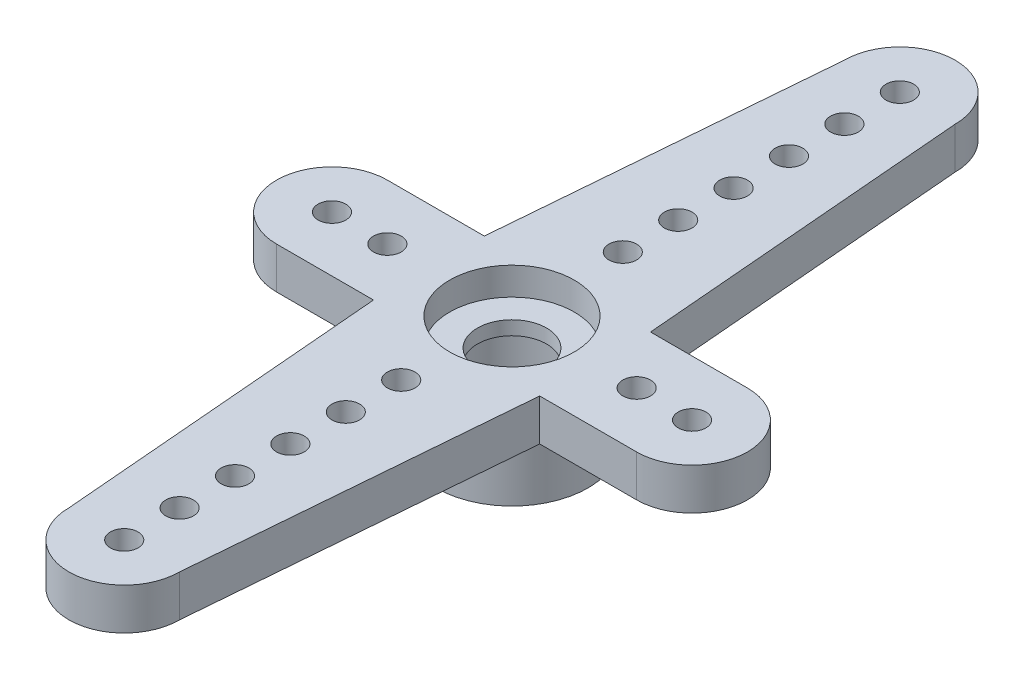
ISO-10303-21;
HEADER;
FILE_DESCRIPTION(('STEP AP214'),'2;1');
FILE_NAME('part.step','',(''),(''),'','','');
FILE_SCHEMA(('AUTOMOTIVE_DESIGN { 1 0 10303 214 1 1 1 1 }'));
ENDSEC;
DATA;
#1=APPLICATION_CONTEXT('core data for automotive mechanical design processes');
#2=APPLICATION_PROTOCOL_DEFINITION('international standard','automotive_design',2000,#1);
#3=PRODUCT_CONTEXT('',#1,'mechanical');
#4=PRODUCT('Part','Part','',(#3));
#5=PRODUCT_RELATED_PRODUCT_CATEGORY('part','',(#4));
#6=PRODUCT_DEFINITION_FORMATION('','',#4);
#7=PRODUCT_DEFINITION_CONTEXT('part definition',#1,'design');
#8=PRODUCT_DEFINITION('design','',#6,#7);
#9=PRODUCT_DEFINITION_SHAPE('','',#8);
#10=(LENGTH_UNIT() NAMED_UNIT(*) SI_UNIT(.MILLI.,.METRE.));
#11=(NAMED_UNIT(*) PLANE_ANGLE_UNIT() SI_UNIT($,.RADIAN.));
#12=(NAMED_UNIT(*) SI_UNIT($,.STERADIAN.) SOLID_ANGLE_UNIT());
#13=UNCERTAINTY_MEASURE_WITH_UNIT(LENGTH_MEASURE(1.E-05),#10,'distance_accuracy_value','');
#14=(GEOMETRIC_REPRESENTATION_CONTEXT(3) GLOBAL_UNCERTAINTY_ASSIGNED_CONTEXT((#13)) GLOBAL_UNIT_ASSIGNED_CONTEXT((#10,
#11,#12)) REPRESENTATION_CONTEXT('',''));
#15=CARTESIAN_POINT('',(0.,0.,0.));
#16=DIRECTION('',(0.,0.,1.));
#17=DIRECTION('',(1.,0.,0.));
#18=AXIS2_PLACEMENT_3D('',#15,#16,#17);
#19=CARTESIAN_POINT('',(0.,0.,0.));
#20=DIRECTION('',(0.,1.,0.));
#21=DIRECTION('',(0.,0.,1.));
#22=AXIS2_PLACEMENT_3D('',#19,#20,#21);
#23=PLANE('',#22);
#24=CARTESIAN_POINT('',(0.,0.,0.));
#25=DIRECTION('',(0.,1.,0.));
#26=DIRECTION('',(0.,0.,1.));
#27=AXIS2_PLACEMENT_3D('',#24,#25,#26);
#28=CIRCLE('',#27,2.75);
#29=CARTESIAN_POINT('',(0.,0.,2.75));
#30=VERTEX_POINT('',#29);
#31=EDGE_CURVE('E36',#30,#30,#28,.T.);
#32=ORIENTED_EDGE('',*,*,#31,.F.);
#33=EDGE_LOOP('',(#32));
#34=FACE_BOUND('',#33,.T.);
#35=CARTESIAN_POINT('',(0.,0.,0.));
#36=DIRECTION('',(0.,1.,0.));
#37=DIRECTION('',(0.,0.,1.));
#38=AXIS2_PLACEMENT_3D('',#35,#36,#37);
#39=CIRCLE('',#38,2.25);
#40=CARTESIAN_POINT('',(0.,0.,2.25));
#41=VERTEX_POINT('',#40);
#42=EDGE_CURVE('E207',#41,#41,#39,.T.);
#43=ORIENTED_EDGE('',*,*,#42,.T.);
#44=EDGE_LOOP('',(#43));
#45=FACE_BOUND('',#44,.T.);
#46=ADVANCED_FACE('F32',(#34,#45),#23,.F.);
#47=CARTESIAN_POINT('',(0.,2.5,0.));
#48=DIRECTION('',(0.,-1.,0.));
#49=DIRECTION('',(0.,0.,-1.));
#50=AXIS2_PLACEMENT_3D('',#47,#48,#49);
#51=CYLINDRICAL_SURFACE('',#50,2.75);
#52=CARTESIAN_POINT('',(0.,2.5,0.));
#53=DIRECTION('',(0.,1.,0.));
#54=DIRECTION('',(0.,0.,1.));
#55=AXIS2_PLACEMENT_3D('',#52,#53,#54);
#56=CIRCLE('',#55,2.75);
#57=CARTESIAN_POINT('',(0.,2.5,2.75));
#58=VERTEX_POINT('',#57);
#59=EDGE_CURVE('E11',#58,#58,#56,.T.);
#60=ORIENTED_EDGE('',*,*,#59,.F.);
#61=EDGE_LOOP('',(#60));
#62=FACE_BOUND('',#61,.T.);
#63=ORIENTED_EDGE('',*,*,#31,.T.);
#64=EDGE_LOOP('',(#63));
#65=FACE_BOUND('',#64,.T.);
#66=ADVANCED_FACE('F34',(#62,#65),#51,.T.);
#67=CARTESIAN_POINT('',(0.,2.5,0.));
#68=DIRECTION('',(0.,-1.,0.));
#69=DIRECTION('',(0.,0.,-1.));
#70=AXIS2_PLACEMENT_3D('',#67,#68,#69);
#71=CYLINDRICAL_SURFACE('',#70,2.25);
#72=CARTESIAN_POINT('',(0.,2.5,0.));
#73=DIRECTION('',(0.,1.,0.));
#74=DIRECTION('',(0.,0.,1.));
#75=AXIS2_PLACEMENT_3D('',#72,#73,#74);
#76=CIRCLE('',#75,2.25);
#77=CARTESIAN_POINT('',(0.,2.5,2.25));
#78=VERTEX_POINT('',#77);
#79=EDGE_CURVE('E204',#78,#78,#76,.T.);
#80=ORIENTED_EDGE('',*,*,#79,.T.);
#81=EDGE_LOOP('',(#80));
#82=FACE_BOUND('',#81,.T.);
#83=ORIENTED_EDGE('',*,*,#42,.F.);
#84=EDGE_LOOP('',(#83));
#85=FACE_BOUND('',#84,.T.);
#86=ADVANCED_FACE('F219',(#82,#85),#71,.F.);
#87=CARTESIAN_POINT('',(6.5,2.5,0.));
#88=DIRECTION('',(0.,1.,0.));
#89=DIRECTION('',(0.,0.,1.));
#90=AXIS2_PLACEMENT_3D('',#87,#88,#89);
#91=PLANE('',#90);
#92=CARTESIAN_POINT('',(0.,2.5,0.));
#93=DIRECTION('',(0.,1.,0.));
#94=DIRECTION('',(0.,0.,1.));
#95=AXIS2_PLACEMENT_3D('',#92,#93,#94);
#96=CIRCLE('',#95,1.25);
#97=CARTESIAN_POINT('',(0.,2.5,1.25));
#98=VERTEX_POINT('',#97);
#99=EDGE_CURVE('E456',#98,#98,#96,.F.);
#100=ORIENTED_EDGE('',*,*,#99,.F.);
#101=EDGE_LOOP('',(#100));
#102=FACE_BOUND('',#101,.T.);
#103=ORIENTED_EDGE('',*,*,#79,.F.);
#104=EDGE_LOOP('',(#103));
#105=FACE_BOUND('',#104,.T.);
#106=ADVANCED_FACE('F224',(#102,#105),#91,.F.);
#107=CARTESIAN_POINT('',(0.,2.5,14.000000000005));
#108=DIRECTION('',(0.,1.,0.));
#109=DIRECTION('',(0.,0.,1.));
#110=AXIS2_PLACEMENT_3D('',#107,#108,#109);
#111=CIRCLE('',#110,0.5);
#112=CARTESIAN_POINT('',(0.,2.5,14.500000000005));
#113=VERTEX_POINT('',#112);
#114=EDGE_CURVE('E358',#113,#113,#111,.T.);
#115=ORIENTED_EDGE('',*,*,#114,.T.);
#116=EDGE_LOOP('',(#115));
#117=FACE_BOUND('',#116,.T.);
#118=CARTESIAN_POINT('',(0.,2.5,12.000000000005));
#119=DIRECTION('',(0.,1.,0.));
#120=DIRECTION('',(0.,0.,1.));
#121=AXIS2_PLACEMENT_3D('',#118,#119,#120);
#122=CIRCLE('',#121,0.5);
#123=CARTESIAN_POINT('',(0.,2.5,12.500000000005));
#124=VERTEX_POINT('',#123);
#125=EDGE_CURVE('E363',#124,#124,#122,.T.);
#126=ORIENTED_EDGE('',*,*,#125,.T.);
#127=EDGE_LOOP('',(#126));
#128=FACE_BOUND('',#127,.T.);
#129=CARTESIAN_POINT('',(0.,2.5,10.000000000005));
#130=DIRECTION('',(0.,1.,0.));
#131=DIRECTION('',(0.,0.,1.));
#132=AXIS2_PLACEMENT_3D('',#129,#130,#131);
#133=CIRCLE('',#132,0.5);
#134=CARTESIAN_POINT('',(0.,2.5,10.500000000005));
#135=VERTEX_POINT('',#134);
#136=EDGE_CURVE('E372',#135,#135,#133,.T.);
#137=ORIENTED_EDGE('',*,*,#136,.T.);
#138=EDGE_LOOP('',(#137));
#139=FACE_BOUND('',#138,.T.);
#140=CARTESIAN_POINT('',(0.,2.5,8.00000000000501));
#141=DIRECTION('',(0.,1.,0.));
#142=DIRECTION('',(0.,0.,1.));
#143=AXIS2_PLACEMENT_3D('',#140,#141,#142);
#144=CIRCLE('',#143,0.5);
#145=CARTESIAN_POINT('',(0.,2.5,8.50000000000501));
#146=VERTEX_POINT('',#145);
#147=EDGE_CURVE('E378',#146,#146,#144,.T.);
#148=ORIENTED_EDGE('',*,*,#147,.T.);
#149=EDGE_LOOP('',(#148));
#150=FACE_BOUND('',#149,.T.);
#151=CARTESIAN_POINT('',(0.,2.5,6.00000000000501));
#152=DIRECTION('',(0.,1.,0.));
#153=DIRECTION('',(0.,0.,1.));
#154=AXIS2_PLACEMENT_3D('',#151,#152,#153);
#155=CIRCLE('',#154,0.5);
#156=CARTESIAN_POINT('',(0.,2.5,6.50000000000501));
#157=VERTEX_POINT('',#156);
#158=EDGE_CURVE('E384',#157,#157,#155,.T.);
#159=ORIENTED_EDGE('',*,*,#158,.T.);
#160=EDGE_LOOP('',(#159));
#161=FACE_BOUND('',#160,.T.);
#162=CARTESIAN_POINT('',(1.26917843951061E-13,2.5,-4.00000000000501));
#163=DIRECTION('',(0.,1.,0.));
#164=DIRECTION('',(0.,0.,1.));
#165=AXIS2_PLACEMENT_3D('',#162,#163,#164);
#166=CIRCLE('',#165,0.5);
#167=CARTESIAN_POINT('',(1.26917843951061E-13,2.5,-3.50000000000501));
#168=VERTEX_POINT('',#167);
#169=EDGE_CURVE('E390',#168,#168,#166,.T.);
#170=ORIENTED_EDGE('',*,*,#169,.T.);
#171=EDGE_LOOP('',(#170));
#172=FACE_BOUND('',#171,.T.);
#173=CARTESIAN_POINT('',(0.,2.5,-6.00000000000501));
#174=DIRECTION('',(0.,1.,0.));
#175=DIRECTION('',(0.,0.,1.));
#176=AXIS2_PLACEMENT_3D('',#173,#174,#175);
#177=CIRCLE('',#176,0.5);
#178=CARTESIAN_POINT('',(0.,2.5,-5.50000000000501));
#179=VERTEX_POINT('',#178);
#180=EDGE_CURVE('E396',#179,#179,#177,.T.);
#181=ORIENTED_EDGE('',*,*,#180,.T.);
#182=EDGE_LOOP('',(#181));
#183=FACE_BOUND('',#182,.T.);
#184=CARTESIAN_POINT('',(0.,2.5,-8.00000000000501));
#185=DIRECTION('',(0.,1.,0.));
#186=DIRECTION('',(0.,0.,1.));
#187=AXIS2_PLACEMENT_3D('',#184,#185,#186);
#188=CIRCLE('',#187,0.5);
#189=CARTESIAN_POINT('',(0.,2.5,-7.50000000000501));
#190=VERTEX_POINT('',#189);
#191=EDGE_CURVE('E402',#190,#190,#188,.T.);
#192=ORIENTED_EDGE('',*,*,#191,.T.);
#193=EDGE_LOOP('',(#192));
#194=FACE_BOUND('',#193,.T.);
#195=CARTESIAN_POINT('',(0.,2.5,-10.000000000005));
#196=DIRECTION('',(0.,1.,0.));
#197=DIRECTION('',(0.,0.,1.));
#198=AXIS2_PLACEMENT_3D('',#195,#196,#197);
#199=CIRCLE('',#198,0.5);
#200=CARTESIAN_POINT('',(0.,2.5,-9.50000000000501));
#201=VERTEX_POINT('',#200);
#202=EDGE_CURVE('E408',#201,#201,#199,.T.);
#203=ORIENTED_EDGE('',*,*,#202,.T.);
#204=EDGE_LOOP('',(#203));
#205=FACE_BOUND('',#204,.T.);
#206=CARTESIAN_POINT('',(0.,2.5,-12.000000000005));
#207=DIRECTION('',(0.,1.,0.));
#208=DIRECTION('',(0.,0.,1.));
#209=AXIS2_PLACEMENT_3D('',#206,#207,#208);
#210=CIRCLE('',#209,0.5);
#211=CARTESIAN_POINT('',(0.,2.5,-11.500000000005));
#212=VERTEX_POINT('',#211);
#213=EDGE_CURVE('E414',#212,#212,#210,.T.);
#214=ORIENTED_EDGE('',*,*,#213,.T.);
#215=EDGE_LOOP('',(#214));
#216=FACE_BOUND('',#215,.T.);
#217=CARTESIAN_POINT('',(1.26917843951061E-13,2.5,4.00000000000501));
#218=DIRECTION('',(0.,1.,0.));
#219=DIRECTION('',(0.,0.,1.));
#220=AXIS2_PLACEMENT_3D('',#217,#218,#219);
#221=CIRCLE('',#220,0.5);
#222=CARTESIAN_POINT('',(1.26917843951061E-13,2.5,4.50000000000501));
#223=VERTEX_POINT('',#222);
#224=EDGE_CURVE('E420',#223,#223,#221,.T.);
#225=ORIENTED_EDGE('',*,*,#224,.T.);
#226=EDGE_LOOP('',(#225));
#227=FACE_BOUND('',#226,.T.);
#228=CARTESIAN_POINT('',(0.,2.5,-14.000000000005));
#229=DIRECTION('',(0.,1.,0.));
#230=DIRECTION('',(0.,0.,1.));
#231=AXIS2_PLACEMENT_3D('',#228,#229,#230);
#232=CIRCLE('',#231,0.5);
#233=CARTESIAN_POINT('',(0.,2.5,-13.500000000005));
#234=VERTEX_POINT('',#233);
#235=EDGE_CURVE('E426',#234,#234,#232,.T.);
#236=ORIENTED_EDGE('',*,*,#235,.T.);
#237=EDGE_LOOP('',(#236));
#238=FACE_BOUND('',#237,.T.);
#239=CARTESIAN_POINT('',(-6.5,2.5,0.));
#240=DIRECTION('',(0.,1.,0.));
#241=DIRECTION('',(0.,0.,1.));
#242=AXIS2_PLACEMENT_3D('',#239,#240,#241);
#243=CIRCLE('',#242,0.500000000000002);
#244=CARTESIAN_POINT('',(-6.5,2.5,0.500000000000002));
#245=VERTEX_POINT('',#244);
#246=EDGE_CURVE('E432',#245,#245,#243,.T.);
#247=ORIENTED_EDGE('',*,*,#246,.T.);
#248=EDGE_LOOP('',(#247));
#249=FACE_BOUND('',#248,.T.);
#250=CARTESIAN_POINT('',(-4.5,2.5,0.));
#251=DIRECTION('',(0.,1.,0.));
#252=DIRECTION('',(0.,0.,1.));
#253=AXIS2_PLACEMENT_3D('',#250,#251,#252);
#254=CIRCLE('',#253,0.500000000000002);
#255=CARTESIAN_POINT('',(-4.5,2.5,0.500000000000002));
#256=VERTEX_POINT('',#255);
#257=EDGE_CURVE('E438',#256,#256,#254,.T.);
#258=ORIENTED_EDGE('',*,*,#257,.T.);
#259=EDGE_LOOP('',(#258));
#260=FACE_BOUND('',#259,.T.);
#261=CARTESIAN_POINT('',(6.5,2.5,0.));
#262=DIRECTION('',(0.,1.,0.));
#263=DIRECTION('',(0.,0.,1.));
#264=AXIS2_PLACEMENT_3D('',#261,#262,#263);
#265=CIRCLE('',#264,0.500000000000001);
#266=CARTESIAN_POINT('',(6.5,2.5,0.500000000000001));
#267=VERTEX_POINT('',#266);
#268=EDGE_CURVE('E444',#267,#267,#265,.T.);
#269=ORIENTED_EDGE('',*,*,#268,.T.);
#270=EDGE_LOOP('',(#269));
#271=FACE_BOUND('',#270,.T.);
#272=CARTESIAN_POINT('',(4.5,2.5,0.));
#273=DIRECTION('',(0.,1.,0.));
#274=DIRECTION('',(0.,0.,1.));
#275=AXIS2_PLACEMENT_3D('',#272,#273,#274);
#276=CIRCLE('',#275,0.5);
#277=CARTESIAN_POINT('',(4.5,2.5,0.5));
#278=VERTEX_POINT('',#277);
#279=EDGE_CURVE('E450',#278,#278,#276,.T.);
#280=ORIENTED_EDGE('',*,*,#279,.T.);
#281=EDGE_LOOP('',(#280));
#282=FACE_BOUND('',#281,.T.);
#283=CARTESIAN_POINT('',(6.5,2.5,0.));
#284=DIRECTION('',(0.,1.,0.));
#285=DIRECTION('',(0.,0.,1.));
#286=AXIS2_PLACEMENT_3D('',#283,#284,#285);
#287=CIRCLE('',#286,2.);
#288=CARTESIAN_POINT('',(6.5,2.5,2.));
#289=VERTEX_POINT('',#288);
#290=CARTESIAN_POINT('',(6.5,2.5,-2.));
#291=VERTEX_POINT('',#290);
#292=EDGE_CURVE('E154',#289,#291,#287,.T.);
#293=ORIENTED_EDGE('',*,*,#292,.F.);
#294=DIRECTION('',(1.,0.,0.));
#295=VECTOR('',#294,1.);
#296=CARTESIAN_POINT('',(3.,2.5,2.));
#297=LINE('',#296,#295);
#298=CARTESIAN_POINT('',(3.,2.5,2.));
#299=VERTEX_POINT('',#298);
#300=EDGE_CURVE('E96',#299,#289,#297,.T.);
#301=ORIENTED_EDGE('',*,*,#300,.F.);
#302=DIRECTION('',(0.0830454798537399,0.,-0.99654575824488));
#303=VECTOR('',#302,1.);
#304=CARTESIAN_POINT('',(3.,2.5,2.));
#305=LINE('',#304,#303);
#306=CARTESIAN_POINT('',(2.,2.5,14.));
#307=VERTEX_POINT('',#306);
#308=EDGE_CURVE('E90',#307,#299,#305,.T.);
#309=ORIENTED_EDGE('',*,*,#308,.F.);
#310=CARTESIAN_POINT('',(0.,2.5,14.000000000005));
#311=DIRECTION('',(0.,1.,0.));
#312=DIRECTION('',(0.,0.,-1.));
#313=AXIS2_PLACEMENT_3D('',#310,#311,#312);
#314=CIRCLE('',#313,2.00000000000005);
#315=CARTESIAN_POINT('',(-2.0000000000001,2.5,14.));
#316=VERTEX_POINT('',#315);
#317=EDGE_CURVE('E144',#316,#307,#314,.T.);
#318=ORIENTED_EDGE('',*,*,#317,.F.);
#319=DIRECTION('',(0.083045479853733,0.,0.99654575824488));
#320=VECTOR('',#319,1.);
#321=CARTESIAN_POINT('',(-3.00000000000001,2.5,2.));
#322=LINE('',#321,#320);
#323=CARTESIAN_POINT('',(-3.00000000000001,2.5,2.));
#324=VERTEX_POINT('',#323);
#325=EDGE_CURVE('E172',#324,#316,#322,.T.);
#326=ORIENTED_EDGE('',*,*,#325,.F.);
#327=DIRECTION('',(1.,0.,0.));
#328=VECTOR('',#327,1.);
#329=CARTESIAN_POINT('',(-6.5,2.5,2.));
#330=LINE('',#329,#328);
#331=CARTESIAN_POINT('',(-6.5,2.5,2.));
#332=VERTEX_POINT('',#331);
#333=EDGE_CURVE('E170',#332,#324,#330,.T.);
#334=ORIENTED_EDGE('',*,*,#333,.F.);
#335=CARTESIAN_POINT('',(-6.5,2.5,0.));
#336=DIRECTION('',(0.,1.,0.));
#337=DIRECTION('',(0.,0.,1.));
#338=AXIS2_PLACEMENT_3D('',#335,#336,#337);
#339=CIRCLE('',#338,2.);
#340=CARTESIAN_POINT('',(-6.5,2.5,-2.));
#341=VERTEX_POINT('',#340);
#342=EDGE_CURVE('E168',#341,#332,#339,.T.);
#343=ORIENTED_EDGE('',*,*,#342,.F.);
#344=DIRECTION('',(-1.,0.,0.));
#345=VECTOR('',#344,1.);
#346=CARTESIAN_POINT('',(-6.5,2.5,-2.));
#347=LINE('',#346,#345);
#348=CARTESIAN_POINT('',(-3.00000000000001,2.5,-2.));
#349=VERTEX_POINT('',#348);
#350=EDGE_CURVE('E166',#349,#341,#347,.T.);
#351=ORIENTED_EDGE('',*,*,#350,.F.);
#352=DIRECTION('',(-0.083045479853733,0.,0.99654575824488));
#353=VECTOR('',#352,1.);
#354=CARTESIAN_POINT('',(-3.00000000000001,2.5,-2.));
#355=LINE('',#354,#353);
#356=CARTESIAN_POINT('',(-2.0000000000001,2.5,-14.));
#357=VERTEX_POINT('',#356);
#358=EDGE_CURVE('E164',#357,#349,#355,.T.);
#359=ORIENTED_EDGE('',*,*,#358,.F.);
#360=CARTESIAN_POINT('',(0.,2.5,-14.000000000005));
#361=DIRECTION('',(0.,1.,0.));
#362=DIRECTION('',(0.,0.,1.));
#363=AXIS2_PLACEMENT_3D('',#360,#361,#362);
#364=CIRCLE('',#363,2.00000000000005);
#365=CARTESIAN_POINT('',(2.,2.5,-14.));
#366=VERTEX_POINT('',#365);
#367=EDGE_CURVE('E162',#366,#357,#364,.T.);
#368=ORIENTED_EDGE('',*,*,#367,.F.);
#369=DIRECTION('',(-0.0830454798537399,0.,-0.99654575824488));
#370=VECTOR('',#369,1.);
#371=CARTESIAN_POINT('',(3.,2.5,-2.));
#372=LINE('',#371,#370);
#373=CARTESIAN_POINT('',(3.,2.5,-2.));
#374=VERTEX_POINT('',#373);
#375=EDGE_CURVE('E160',#374,#366,#372,.T.);
#376=ORIENTED_EDGE('',*,*,#375,.F.);
#377=DIRECTION('',(-1.,0.,0.));
#378=VECTOR('',#377,1.);
#379=CARTESIAN_POINT('',(3.,2.5,-2.));
#380=LINE('',#379,#378);
#381=EDGE_CURVE('E157',#291,#374,#380,.T.);
#382=ORIENTED_EDGE('',*,*,#381,.F.);
#383=EDGE_LOOP('',(#293,#301,#309,#318,#326,#334,#343,#351,#359,#368,#376,#382));
#384=FACE_BOUND('',#383,.T.);
#385=ORIENTED_EDGE('',*,*,#59,.T.);
#386=EDGE_LOOP('',(#385));
#387=FACE_BOUND('',#386,.T.);
#388=ADVANCED_FACE('F230',(#117,#128,#139,#150,#161,#172,#183,#194,#205,#216,#227,#238,#249,
#260,#271,#282,#384,#387),#91,.F.);
#389=CARTESIAN_POINT('',(6.5,4.,0.));
#390=DIRECTION('',(0.,-1.,0.));
#391=DIRECTION('',(0.,0.,-1.));
#392=AXIS2_PLACEMENT_3D('',#389,#390,#391);
#393=CYLINDRICAL_SURFACE('',#392,2.);
#394=ORIENTED_EDGE('',*,*,#292,.T.);
#395=DIRECTION('',(0.,-1.,0.));
#396=VECTOR('',#395,1.);
#397=CARTESIAN_POINT('',(6.5,4.,-2.));
#398=LINE('',#397,#396);
#399=CARTESIAN_POINT('',(6.5,4.,-2.));
#400=VERTEX_POINT('',#399);
#401=EDGE_CURVE('E202',#400,#291,#398,.T.);
#402=ORIENTED_EDGE('',*,*,#401,.F.);
#403=CARTESIAN_POINT('',(6.5,4.,0.));
#404=DIRECTION('',(0.,1.,0.));
#405=DIRECTION('',(0.,0.,1.));
#406=AXIS2_PLACEMENT_3D('',#403,#404,#405);
#407=CIRCLE('',#406,2.);
#408=CARTESIAN_POINT('',(6.5,4.,2.));
#409=VERTEX_POINT('',#408);
#410=EDGE_CURVE('E177',#409,#400,#407,.T.);
#411=ORIENTED_EDGE('',*,*,#410,.F.);
#412=DIRECTION('',(0.,-1.,0.));
#413=VECTOR('',#412,1.);
#414=CARTESIAN_POINT('',(6.5,4.,2.));
#415=LINE('',#414,#413);
#416=EDGE_CURVE('E150',#409,#289,#415,.T.);
#417=ORIENTED_EDGE('',*,*,#416,.T.);
#418=EDGE_LOOP('',(#394,#402,#411,#417));
#419=FACE_BOUND('',#418,.T.);
#420=ADVANCED_FACE('F226',(#419),#393,.T.);
#421=CARTESIAN_POINT('',(3.,4.,-2.));
#422=DIRECTION('',(0.,0.,1.));
#423=DIRECTION('',(1.,0.,0.));
#424=AXIS2_PLACEMENT_3D('',#421,#422,#423);
#425=PLANE('',#424);
#426=ORIENTED_EDGE('',*,*,#381,.T.);
#427=DIRECTION('',(0.,-1.,0.));
#428=VECTOR('',#427,1.);
#429=CARTESIAN_POINT('',(3.,4.,-2.));
#430=LINE('',#429,#428);
#431=CARTESIAN_POINT('',(3.,4.,-2.));
#432=VERTEX_POINT('',#431);
#433=EDGE_CURVE('E199',#432,#374,#430,.T.);
#434=ORIENTED_EDGE('',*,*,#433,.F.);
#435=DIRECTION('',(-1.,0.,0.));
#436=VECTOR('',#435,1.);
#437=CARTESIAN_POINT('',(3.,4.,-2.));
#438=LINE('',#437,#436);
#439=EDGE_CURVE('E105',#400,#432,#438,.T.);
#440=ORIENTED_EDGE('',*,*,#439,.F.);
#441=ORIENTED_EDGE('',*,*,#401,.T.);
#442=EDGE_LOOP('',(#426,#434,#440,#441));
#443=FACE_BOUND('',#442,.T.);
#444=ADVANCED_FACE('F229',(#443),#425,.F.);
#445=CARTESIAN_POINT('',(3.,4.,-2.));
#446=DIRECTION('',(-0.99654575824488,0.,0.0830454798537399));
#447=DIRECTION('',(0.0830454798537399,0.,0.99654575824488));
#448=AXIS2_PLACEMENT_3D('',#445,#446,#447);
#449=PLANE('',#448);
#450=ORIENTED_EDGE('',*,*,#375,.T.);
#451=DIRECTION('',(0.,-1.,0.));
#452=VECTOR('',#451,1.);
#453=CARTESIAN_POINT('',(2.,4.,-14.));
#454=LINE('',#453,#452);
#455=CARTESIAN_POINT('',(2.,4.,-14.));
#456=VERTEX_POINT('',#455);
#457=EDGE_CURVE('E196',#456,#366,#454,.T.);
#458=ORIENTED_EDGE('',*,*,#457,.F.);
#459=DIRECTION('',(-0.0830454798537399,0.,-0.99654575824488));
#460=VECTOR('',#459,1.);
#461=CARTESIAN_POINT('',(3.,4.,-2.));
#462=LINE('',#461,#460);
#463=EDGE_CURVE('E466',#432,#456,#462,.T.);
#464=ORIENTED_EDGE('',*,*,#463,.F.);
#465=ORIENTED_EDGE('',*,*,#433,.T.);
#466=EDGE_LOOP('',(#450,#458,#464,#465));
#467=FACE_BOUND('',#466,.T.);
#468=ADVANCED_FACE('F234',(#467),#449,.F.);
#469=CARTESIAN_POINT('',(0.,4.,-14.000000000005));
#470=DIRECTION('',(0.,-1.,0.));
#471=DIRECTION('',(0.,0.,-1.));
#472=AXIS2_PLACEMENT_3D('',#469,#470,#471);
#473=CYLINDRICAL_SURFACE('',#472,2.00000000000005);
#474=ORIENTED_EDGE('',*,*,#367,.T.);
#475=DIRECTION('',(0.,-1.,0.));
#476=VECTOR('',#475,1.);
#477=CARTESIAN_POINT('',(-2.0000000000001,4.,-14.));
#478=LINE('',#477,#476);
#479=CARTESIAN_POINT('',(-2.0000000000001,4.,-14.));
#480=VERTEX_POINT('',#479);
#481=EDGE_CURVE('E193',#480,#357,#478,.T.);
#482=ORIENTED_EDGE('',*,*,#481,.F.);
#483=CARTESIAN_POINT('',(0.,4.,-14.000000000005));
#484=DIRECTION('',(0.,1.,0.));
#485=DIRECTION('',(0.,0.,1.));
#486=AXIS2_PLACEMENT_3D('',#483,#484,#485);
#487=CIRCLE('',#486,2.00000000000005);
#488=EDGE_CURVE('E468',#456,#480,#487,.T.);
#489=ORIENTED_EDGE('',*,*,#488,.F.);
#490=ORIENTED_EDGE('',*,*,#457,.T.);
#491=EDGE_LOOP('',(#474,#482,#489,#490));
#492=FACE_BOUND('',#491,.T.);
#493=ADVANCED_FACE('F237',(#492),#473,.T.);
#494=CARTESIAN_POINT('',(-3.00000000000001,4.,-2.));
#495=DIRECTION('',(0.99654575824488,0.,0.083045479853733));
#496=DIRECTION('',(0.083045479853733,0.,-0.99654575824488));
#497=AXIS2_PLACEMENT_3D('',#494,#495,#496);
#498=PLANE('',#497);
#499=ORIENTED_EDGE('',*,*,#358,.T.);
#500=DIRECTION('',(0.,-1.,0.));
#501=VECTOR('',#500,1.);
#502=CARTESIAN_POINT('',(-3.00000000000001,4.,-2.));
#503=LINE('',#502,#501);
#504=CARTESIAN_POINT('',(-3.00000000000001,4.,-2.));
#505=VERTEX_POINT('',#504);
#506=EDGE_CURVE('E190',#505,#349,#503,.T.);
#507=ORIENTED_EDGE('',*,*,#506,.F.);
#508=DIRECTION('',(-0.083045479853733,0.,0.99654575824488));
#509=VECTOR('',#508,1.);
#510=CARTESIAN_POINT('',(-3.00000000000001,4.,-2.));
#511=LINE('',#510,#509);
#512=EDGE_CURVE('E470',#480,#505,#511,.T.);
#513=ORIENTED_EDGE('',*,*,#512,.F.);
#514=ORIENTED_EDGE('',*,*,#481,.T.);
#515=EDGE_LOOP('',(#499,#507,#513,#514));
#516=FACE_BOUND('',#515,.T.);
#517=ADVANCED_FACE('F241',(#516),#498,.F.);
#518=CARTESIAN_POINT('',(-6.5,4.,-2.));
#519=DIRECTION('',(0.,0.,1.));
#520=DIRECTION('',(1.,0.,0.));
#521=AXIS2_PLACEMENT_3D('',#518,#519,#520);
#522=PLANE('',#521);
#523=ORIENTED_EDGE('',*,*,#350,.T.);
#524=DIRECTION('',(0.,-1.,0.));
#525=VECTOR('',#524,1.);
#526=CARTESIAN_POINT('',(-6.5,4.,-2.));
#527=LINE('',#526,#525);
#528=CARTESIAN_POINT('',(-6.5,4.,-2.));
#529=VERTEX_POINT('',#528);
#530=EDGE_CURVE('E187',#529,#341,#527,.T.);
#531=ORIENTED_EDGE('',*,*,#530,.F.);
#532=DIRECTION('',(-1.,0.,0.));
#533=VECTOR('',#532,1.);
#534=CARTESIAN_POINT('',(-6.5,4.,-2.));
#535=LINE('',#534,#533);
#536=EDGE_CURVE('E472',#505,#529,#535,.T.);
#537=ORIENTED_EDGE('',*,*,#536,.F.);
#538=ORIENTED_EDGE('',*,*,#506,.T.);
#539=EDGE_LOOP('',(#523,#531,#537,#538));
#540=FACE_BOUND('',#539,.T.);
#541=ADVANCED_FACE('F245',(#540),#522,.F.);
#542=CARTESIAN_POINT('',(-6.5,4.,0.));
#543=DIRECTION('',(0.,-1.,0.));
#544=DIRECTION('',(0.,0.,-1.));
#545=AXIS2_PLACEMENT_3D('',#542,#543,#544);
#546=CYLINDRICAL_SURFACE('',#545,2.);
#547=ORIENTED_EDGE('',*,*,#342,.T.);
#548=DIRECTION('',(0.,-1.,0.));
#549=VECTOR('',#548,1.);
#550=CARTESIAN_POINT('',(-6.5,4.,2.));
#551=LINE('',#550,#549);
#552=CARTESIAN_POINT('',(-6.5,4.,2.));
#553=VERTEX_POINT('',#552);
#554=EDGE_CURVE('E184',#553,#332,#551,.T.);
#555=ORIENTED_EDGE('',*,*,#554,.F.);
#556=CARTESIAN_POINT('',(-6.5,4.,0.));
#557=DIRECTION('',(0.,1.,0.));
#558=DIRECTION('',(0.,0.,1.));
#559=AXIS2_PLACEMENT_3D('',#556,#557,#558);
#560=CIRCLE('',#559,2.);
#561=EDGE_CURVE('E474',#529,#553,#560,.T.);
#562=ORIENTED_EDGE('',*,*,#561,.F.);
#563=ORIENTED_EDGE('',*,*,#530,.T.);
#564=EDGE_LOOP('',(#547,#555,#562,#563));
#565=FACE_BOUND('',#564,.T.);
#566=ADVANCED_FACE('F249',(#565),#546,.T.);
#567=CARTESIAN_POINT('',(-6.5,4.,2.));
#568=DIRECTION('',(0.,0.,-1.));
#569=DIRECTION('',(-1.,0.,0.));
#570=AXIS2_PLACEMENT_3D('',#567,#568,#569);
#571=PLANE('',#570);
#572=ORIENTED_EDGE('',*,*,#333,.T.);
#573=DIRECTION('',(0.,-1.,0.));
#574=VECTOR('',#573,1.);
#575=CARTESIAN_POINT('',(-3.00000000000001,4.,2.));
#576=LINE('',#575,#574);
#577=CARTESIAN_POINT('',(-3.00000000000001,4.,2.));
#578=VERTEX_POINT('',#577);
#579=EDGE_CURVE('E181',#578,#324,#576,.T.);
#580=ORIENTED_EDGE('',*,*,#579,.F.);
#581=DIRECTION('',(1.,0.,0.));
#582=VECTOR('',#581,1.);
#583=CARTESIAN_POINT('',(-6.5,4.,2.));
#584=LINE('',#583,#582);
#585=EDGE_CURVE('E476',#553,#578,#584,.T.);
#586=ORIENTED_EDGE('',*,*,#585,.F.);
#587=ORIENTED_EDGE('',*,*,#554,.T.);
#588=EDGE_LOOP('',(#572,#580,#586,#587));
#589=FACE_BOUND('',#588,.T.);
#590=ADVANCED_FACE('F253',(#589),#571,.F.);
#591=CARTESIAN_POINT('',(-3.00000000000001,4.,2.));
#592=DIRECTION('',(0.99654575824488,0.,-0.083045479853733));
#593=DIRECTION('',(-0.083045479853733,0.,-0.99654575824488));
#594=AXIS2_PLACEMENT_3D('',#591,#592,#593);
#595=PLANE('',#594);
#596=ORIENTED_EDGE('',*,*,#325,.T.);
#597=DIRECTION('',(0.,-1.,0.));
#598=VECTOR('',#597,1.);
#599=CARTESIAN_POINT('',(-2.0000000000001,4.,14.));
#600=LINE('',#599,#598);
#601=CARTESIAN_POINT('',(-2.0000000000001,4.,14.));
#602=VERTEX_POINT('',#601);
#603=EDGE_CURVE('E145',#602,#316,#600,.T.);
#604=ORIENTED_EDGE('',*,*,#603,.F.);
#605=DIRECTION('',(0.083045479853733,0.,0.99654575824488));
#606=VECTOR('',#605,1.);
#607=CARTESIAN_POINT('',(-3.00000000000001,4.,2.));
#608=LINE('',#607,#606);
#609=EDGE_CURVE('E136',#578,#602,#608,.T.);
#610=ORIENTED_EDGE('',*,*,#609,.F.);
#611=ORIENTED_EDGE('',*,*,#579,.T.);
#612=EDGE_LOOP('',(#596,#604,#610,#611));
#613=FACE_BOUND('',#612,.T.);
#614=ADVANCED_FACE('F257',(#613),#595,.F.);
#615=CARTESIAN_POINT('',(0.,4.,14.000000000005));
#616=DIRECTION('',(0.,-1.,0.));
#617=DIRECTION('',(0.,0.,-1.));
#618=AXIS2_PLACEMENT_3D('',#615,#616,#617);
#619=CYLINDRICAL_SURFACE('',#618,2.00000000000005);
#620=ORIENTED_EDGE('',*,*,#317,.T.);
#621=DIRECTION('',(0.,-1.,0.));
#622=VECTOR('',#621,1.);
#623=CARTESIAN_POINT('',(2.,4.,14.));
#624=LINE('',#623,#622);
#625=CARTESIAN_POINT('',(2.,4.,14.));
#626=VERTEX_POINT('',#625);
#627=EDGE_CURVE('E141',#626,#307,#624,.T.);
#628=ORIENTED_EDGE('',*,*,#627,.F.);
#629=CARTESIAN_POINT('',(0.,4.,14.000000000005));
#630=DIRECTION('',(0.,1.,0.));
#631=DIRECTION('',(0.,0.,-1.));
#632=AXIS2_PLACEMENT_3D('',#629,#630,#631);
#633=CIRCLE('',#632,2.00000000000005);
#634=EDGE_CURVE('E130',#602,#626,#633,.T.);
#635=ORIENTED_EDGE('',*,*,#634,.F.);
#636=ORIENTED_EDGE('',*,*,#603,.T.);
#637=EDGE_LOOP('',(#620,#628,#635,#636));
#638=FACE_BOUND('',#637,.T.);
#639=ADVANCED_FACE('F142',(#638),#619,.T.);
#640=CARTESIAN_POINT('',(3.,4.,2.));
#641=DIRECTION('',(-0.99654575824488,0.,-0.0830454798537399));
#642=DIRECTION('',(-0.0830454798537399,0.,0.99654575824488));
#643=AXIS2_PLACEMENT_3D('',#640,#641,#642);
#644=PLANE('',#643);
#645=ORIENTED_EDGE('',*,*,#308,.T.);
#646=DIRECTION('',(0.,-1.,0.));
#647=VECTOR('',#646,1.);
#648=CARTESIAN_POINT('',(3.,4.,2.));
#649=LINE('',#648,#647);
#650=CARTESIAN_POINT('',(3.,4.,2.));
#651=VERTEX_POINT('',#650);
#652=EDGE_CURVE('E146',#651,#299,#649,.T.);
#653=ORIENTED_EDGE('',*,*,#652,.F.);
#654=DIRECTION('',(0.0830454798537399,0.,-0.99654575824488));
#655=VECTOR('',#654,1.);
#656=CARTESIAN_POINT('',(3.,4.,2.));
#657=LINE('',#656,#655);
#658=EDGE_CURVE('E134',#626,#651,#657,.T.);
#659=ORIENTED_EDGE('',*,*,#658,.F.);
#660=ORIENTED_EDGE('',*,*,#627,.T.);
#661=EDGE_LOOP('',(#645,#653,#659,#660));
#662=FACE_BOUND('',#661,.T.);
#663=ADVANCED_FACE('F148',(#662),#644,.F.);
#664=CARTESIAN_POINT('',(3.,4.,2.));
#665=DIRECTION('',(0.,0.,-1.));
#666=DIRECTION('',(-1.,0.,0.));
#667=AXIS2_PLACEMENT_3D('',#664,#665,#666);
#668=PLANE('',#667);
#669=ORIENTED_EDGE('',*,*,#300,.T.);
#670=ORIENTED_EDGE('',*,*,#416,.F.);
#671=DIRECTION('',(1.,0.,0.));
#672=VECTOR('',#671,1.);
#673=CARTESIAN_POINT('',(3.,4.,2.));
#674=LINE('',#673,#672);
#675=EDGE_CURVE('E49',#651,#409,#674,.T.);
#676=ORIENTED_EDGE('',*,*,#675,.F.);
#677=ORIENTED_EDGE('',*,*,#652,.T.);
#678=EDGE_LOOP('',(#669,#670,#676,#677));
#679=FACE_BOUND('',#678,.T.);
#680=ADVANCED_FACE('F266',(#679),#668,.F.);
#681=CARTESIAN_POINT('',(6.5,4.,0.));
#682=DIRECTION('',(0.,1.,0.));
#683=DIRECTION('',(0.,0.,1.));
#684=AXIS2_PLACEMENT_3D('',#681,#682,#683);
#685=PLANE('',#684);
#686=CARTESIAN_POINT('',(0.,4.,14.000000000005));
#687=DIRECTION('',(0.,1.,0.));
#688=DIRECTION('',(0.,0.,-1.));
#689=AXIS2_PLACEMENT_3D('',#686,#687,#688);
#690=CIRCLE('',#689,0.5);
#691=CARTESIAN_POINT('',(0.,4.,13.500000000005));
#692=VERTEX_POINT('',#691);
#693=EDGE_CURVE('E355',#692,#692,#690,.T.);
#694=ORIENTED_EDGE('',*,*,#693,.F.);
#695=EDGE_LOOP('',(#694));
#696=FACE_BOUND('',#695,.T.);
#697=CARTESIAN_POINT('',(0.,4.,12.000000000005));
#698=DIRECTION('',(0.,1.,0.));
#699=DIRECTION('',(0.,0.,-1.));
#700=AXIS2_PLACEMENT_3D('',#697,#698,#699);
#701=CIRCLE('',#700,0.5);
#702=CARTESIAN_POINT('',(0.,4.,11.500000000005));
#703=VERTEX_POINT('',#702);
#704=EDGE_CURVE('E360',#703,#703,#701,.T.);
#705=ORIENTED_EDGE('',*,*,#704,.F.);
#706=EDGE_LOOP('',(#705));
#707=FACE_BOUND('',#706,.T.);
#708=CARTESIAN_POINT('',(0.,4.,10.000000000005));
#709=DIRECTION('',(0.,1.,0.));
#710=DIRECTION('',(0.,0.,-1.));
#711=AXIS2_PLACEMENT_3D('',#708,#709,#710);
#712=CIRCLE('',#711,0.5);
#713=CARTESIAN_POINT('',(0.,4.,9.50000000000501));
#714=VERTEX_POINT('',#713);
#715=EDGE_CURVE('E369',#714,#714,#712,.T.);
#716=ORIENTED_EDGE('',*,*,#715,.F.);
#717=EDGE_LOOP('',(#716));
#718=FACE_BOUND('',#717,.T.);
#719=CARTESIAN_POINT('',(0.,4.,8.00000000000501));
#720=DIRECTION('',(0.,1.,0.));
#721=DIRECTION('',(0.,0.,-1.));
#722=AXIS2_PLACEMENT_3D('',#719,#720,#721);
#723=CIRCLE('',#722,0.5);
#724=CARTESIAN_POINT('',(0.,4.,7.50000000000501));
#725=VERTEX_POINT('',#724);
#726=EDGE_CURVE('E375',#725,#725,#723,.T.);
#727=ORIENTED_EDGE('',*,*,#726,.F.);
#728=EDGE_LOOP('',(#727));
#729=FACE_BOUND('',#728,.T.);
#730=CARTESIAN_POINT('',(0.,4.,6.00000000000501));
#731=DIRECTION('',(0.,1.,0.));
#732=DIRECTION('',(0.,0.,-1.));
#733=AXIS2_PLACEMENT_3D('',#730,#731,#732);
#734=CIRCLE('',#733,0.5);
#735=CARTESIAN_POINT('',(0.,4.,5.50000000000501));
#736=VERTEX_POINT('',#735);
#737=EDGE_CURVE('E381',#736,#736,#734,.T.);
#738=ORIENTED_EDGE('',*,*,#737,.F.);
#739=EDGE_LOOP('',(#738));
#740=FACE_BOUND('',#739,.T.);
#741=CARTESIAN_POINT('',(1.26917843951061E-13,4.,-4.00000000000501));
#742=DIRECTION('',(0.,1.,0.));
#743=DIRECTION('',(0.,0.,1.));
#744=AXIS2_PLACEMENT_3D('',#741,#742,#743);
#745=CIRCLE('',#744,0.5);
#746=CARTESIAN_POINT('',(1.26917843951061E-13,4.,-3.50000000000501));
#747=VERTEX_POINT('',#746);
#748=EDGE_CURVE('E387',#747,#747,#745,.T.);
#749=ORIENTED_EDGE('',*,*,#748,.F.);
#750=EDGE_LOOP('',(#749));
#751=FACE_BOUND('',#750,.T.);
#752=CARTESIAN_POINT('',(0.,4.,-6.00000000000501));
#753=DIRECTION('',(0.,1.,0.));
#754=DIRECTION('',(0.,0.,1.));
#755=AXIS2_PLACEMENT_3D('',#752,#753,#754);
#756=CIRCLE('',#755,0.5);
#757=CARTESIAN_POINT('',(0.,4.,-5.50000000000501));
#758=VERTEX_POINT('',#757);
#759=EDGE_CURVE('E393',#758,#758,#756,.T.);
#760=ORIENTED_EDGE('',*,*,#759,.F.);
#761=EDGE_LOOP('',(#760));
#762=FACE_BOUND('',#761,.T.);
#763=CARTESIAN_POINT('',(0.,4.,-8.00000000000501));
#764=DIRECTION('',(0.,1.,0.));
#765=DIRECTION('',(0.,0.,1.));
#766=AXIS2_PLACEMENT_3D('',#763,#764,#765);
#767=CIRCLE('',#766,0.5);
#768=CARTESIAN_POINT('',(0.,4.,-7.50000000000501));
#769=VERTEX_POINT('',#768);
#770=EDGE_CURVE('E399',#769,#769,#767,.T.);
#771=ORIENTED_EDGE('',*,*,#770,.F.);
#772=EDGE_LOOP('',(#771));
#773=FACE_BOUND('',#772,.T.);
#774=CARTESIAN_POINT('',(0.,4.,-10.000000000005));
#775=DIRECTION('',(0.,1.,0.));
#776=DIRECTION('',(0.,0.,1.));
#777=AXIS2_PLACEMENT_3D('',#774,#775,#776);
#778=CIRCLE('',#777,0.5);
#779=CARTESIAN_POINT('',(0.,4.,-9.50000000000501));
#780=VERTEX_POINT('',#779);
#781=EDGE_CURVE('E405',#780,#780,#778,.T.);
#782=ORIENTED_EDGE('',*,*,#781,.F.);
#783=EDGE_LOOP('',(#782));
#784=FACE_BOUND('',#783,.T.);
#785=CARTESIAN_POINT('',(0.,4.,-12.000000000005));
#786=DIRECTION('',(0.,1.,0.));
#787=DIRECTION('',(0.,0.,1.));
#788=AXIS2_PLACEMENT_3D('',#785,#786,#787);
#789=CIRCLE('',#788,0.5);
#790=CARTESIAN_POINT('',(0.,4.,-11.500000000005));
#791=VERTEX_POINT('',#790);
#792=EDGE_CURVE('E411',#791,#791,#789,.T.);
#793=ORIENTED_EDGE('',*,*,#792,.F.);
#794=EDGE_LOOP('',(#793));
#795=FACE_BOUND('',#794,.T.);
#796=CARTESIAN_POINT('',(1.26917843951061E-13,4.,4.00000000000501));
#797=DIRECTION('',(0.,1.,0.));
#798=DIRECTION('',(0.,0.,-1.));
#799=AXIS2_PLACEMENT_3D('',#796,#797,#798);
#800=CIRCLE('',#799,0.5);
#801=CARTESIAN_POINT('',(1.26917843951061E-13,4.,3.50000000000501));
#802=VERTEX_POINT('',#801);
#803=EDGE_CURVE('E417',#802,#802,#800,.T.);
#804=ORIENTED_EDGE('',*,*,#803,.F.);
#805=EDGE_LOOP('',(#804));
#806=FACE_BOUND('',#805,.T.);
#807=CARTESIAN_POINT('',(0.,4.,-14.000000000005));
#808=DIRECTION('',(0.,1.,0.));
#809=DIRECTION('',(0.,0.,1.));
#810=AXIS2_PLACEMENT_3D('',#807,#808,#809);
#811=CIRCLE('',#810,0.5);
#812=CARTESIAN_POINT('',(0.,4.,-13.500000000005));
#813=VERTEX_POINT('',#812);
#814=EDGE_CURVE('E423',#813,#813,#811,.T.);
#815=ORIENTED_EDGE('',*,*,#814,.F.);
#816=EDGE_LOOP('',(#815));
#817=FACE_BOUND('',#816,.T.);
#818=CARTESIAN_POINT('',(-6.5,4.,0.));
#819=DIRECTION('',(0.,1.,0.));
#820=DIRECTION('',(0.,0.,-1.));
#821=AXIS2_PLACEMENT_3D('',#818,#819,#820);
#822=CIRCLE('',#821,0.500000000000002);
#823=CARTESIAN_POINT('',(-6.5,4.,-0.500000000000002));
#824=VERTEX_POINT('',#823);
#825=EDGE_CURVE('E429',#824,#824,#822,.T.);
#826=ORIENTED_EDGE('',*,*,#825,.F.);
#827=EDGE_LOOP('',(#826));
#828=FACE_BOUND('',#827,.T.);
#829=CARTESIAN_POINT('',(-4.5,4.,0.));
#830=DIRECTION('',(0.,1.,0.));
#831=DIRECTION('',(0.,0.,-1.));
#832=AXIS2_PLACEMENT_3D('',#829,#830,#831);
#833=CIRCLE('',#832,0.500000000000002);
#834=CARTESIAN_POINT('',(-4.5,4.,-0.500000000000002));
#835=VERTEX_POINT('',#834);
#836=EDGE_CURVE('E435',#835,#835,#833,.T.);
#837=ORIENTED_EDGE('',*,*,#836,.F.);
#838=EDGE_LOOP('',(#837));
#839=FACE_BOUND('',#838,.T.);
#840=CARTESIAN_POINT('',(6.5,4.,0.));
#841=DIRECTION('',(0.,1.,0.));
#842=DIRECTION('',(0.,0.,1.));
#843=AXIS2_PLACEMENT_3D('',#840,#841,#842);
#844=CIRCLE('',#843,0.500000000000001);
#845=CARTESIAN_POINT('',(6.5,4.,0.500000000000001));
#846=VERTEX_POINT('',#845);
#847=EDGE_CURVE('E441',#846,#846,#844,.T.);
#848=ORIENTED_EDGE('',*,*,#847,.F.);
#849=EDGE_LOOP('',(#848));
#850=FACE_BOUND('',#849,.T.);
#851=CARTESIAN_POINT('',(4.5,4.,0.));
#852=DIRECTION('',(0.,1.,0.));
#853=DIRECTION('',(0.,0.,1.));
#854=AXIS2_PLACEMENT_3D('',#851,#852,#853);
#855=CIRCLE('',#854,0.5);
#856=CARTESIAN_POINT('',(4.5,4.,0.5));
#857=VERTEX_POINT('',#856);
#858=EDGE_CURVE('E447',#857,#857,#855,.T.);
#859=ORIENTED_EDGE('',*,*,#858,.F.);
#860=EDGE_LOOP('',(#859));
#861=FACE_BOUND('',#860,.T.);
#862=CARTESIAN_POINT('',(0.,4.,0.));
#863=DIRECTION('',(0.,1.,0.));
#864=DIRECTION('',(0.,0.,1.));
#865=AXIS2_PLACEMENT_3D('',#862,#863,#864);
#866=CIRCLE('',#865,2.25);
#867=CARTESIAN_POINT('',(0.,4.,2.25));
#868=VERTEX_POINT('',#867);
#869=EDGE_CURVE('E459',#868,#868,#866,.T.);
#870=ORIENTED_EDGE('',*,*,#869,.F.);
#871=EDGE_LOOP('',(#870));
#872=FACE_BOUND('',#871,.T.);
#873=ORIENTED_EDGE('',*,*,#410,.T.);
#874=ORIENTED_EDGE('',*,*,#439,.T.);
#875=ORIENTED_EDGE('',*,*,#463,.T.);
#876=ORIENTED_EDGE('',*,*,#488,.T.);
#877=ORIENTED_EDGE('',*,*,#512,.T.);
#878=ORIENTED_EDGE('',*,*,#536,.T.);
#879=ORIENTED_EDGE('',*,*,#561,.T.);
#880=ORIENTED_EDGE('',*,*,#585,.T.);
#881=ORIENTED_EDGE('',*,*,#609,.T.);
#882=ORIENTED_EDGE('',*,*,#634,.T.);
#883=ORIENTED_EDGE('',*,*,#658,.T.);
#884=ORIENTED_EDGE('',*,*,#675,.T.);
#885=EDGE_LOOP('',(#873,#874,#875,#876,#877,#878,#879,#880,#881,#882,#883,#884));
#886=FACE_BOUND('',#885,.T.);
#887=ADVANCED_FACE('F132',(#696,#707,#718,#729,#740,#751,#762,#773,#784,#795,#806,#817,#828,
#839,#850,#861,#872,#886),#685,.T.);
#888=CARTESIAN_POINT('',(0.,3.,0.));
#889=DIRECTION('',(0.,1.,0.));
#890=DIRECTION('',(0.,0.,1.));
#891=AXIS2_PLACEMENT_3D('',#888,#889,#890);
#892=CYLINDRICAL_SURFACE('',#891,2.25);
#893=CARTESIAN_POINT('',(0.,3.,0.));
#894=DIRECTION('',(0.,1.,0.));
#895=DIRECTION('',(0.,0.,1.));
#896=AXIS2_PLACEMENT_3D('',#893,#894,#895);
#897=CIRCLE('',#896,2.25);
#898=CARTESIAN_POINT('',(0.,3.,2.25));
#899=VERTEX_POINT('',#898);
#900=EDGE_CURVE('E158',#899,#899,#897,.T.);
#901=ORIENTED_EDGE('',*,*,#900,.F.);
#902=EDGE_LOOP('',(#901));
#903=FACE_BOUND('',#902,.T.);
#904=ORIENTED_EDGE('',*,*,#869,.T.);
#905=EDGE_LOOP('',(#904));
#906=FACE_BOUND('',#905,.T.);
#907=ADVANCED_FACE('F274',(#903,#906),#892,.F.);
#908=CARTESIAN_POINT('',(0.,3.,0.));
#909=DIRECTION('',(0.,1.,0.));
#910=DIRECTION('',(0.,0.,1.));
#911=AXIS2_PLACEMENT_3D('',#908,#909,#910);
#912=PLANE('',#911);
#913=CARTESIAN_POINT('',(0.,3.,0.));
#914=DIRECTION('',(0.,1.,0.));
#915=DIRECTION('',(0.,0.,1.));
#916=AXIS2_PLACEMENT_3D('',#913,#914,#915);
#917=CIRCLE('',#916,1.25);
#918=CARTESIAN_POINT('',(0.,3.,1.25));
#919=VERTEX_POINT('',#918);
#920=EDGE_CURVE('E453',#919,#919,#917,.T.);
#921=ORIENTED_EDGE('',*,*,#920,.F.);
#922=EDGE_LOOP('',(#921));
#923=FACE_BOUND('',#922,.T.);
#924=ORIENTED_EDGE('',*,*,#900,.T.);
#925=EDGE_LOOP('',(#924));
#926=FACE_BOUND('',#925,.T.);
#927=ADVANCED_FACE('F278',(#923,#926),#912,.T.);
#928=CARTESIAN_POINT('',(0.,-0.00100000000000013,0.));
#929=DIRECTION('',(0.,1.,0.));
#930=DIRECTION('',(0.,0.,1.));
#931=AXIS2_PLACEMENT_3D('',#928,#929,#930);
#932=CYLINDRICAL_SURFACE('',#931,1.25);
#933=ORIENTED_EDGE('',*,*,#920,.T.);
#934=EDGE_LOOP('',(#933));
#935=FACE_BOUND('',#934,.T.);
#936=ORIENTED_EDGE('',*,*,#99,.T.);
#937=EDGE_LOOP('',(#936));
#938=FACE_BOUND('',#937,.T.);
#939=ADVANCED_FACE('F282',(#935,#938),#932,.F.);
#940=CARTESIAN_POINT('',(4.5,0.,0.));
#941=DIRECTION('',(0.,1.,0.));
#942=DIRECTION('',(0.,0.,1.));
#943=AXIS2_PLACEMENT_3D('',#940,#941,#942);
#944=CYLINDRICAL_SURFACE('',#943,0.5);
#945=ORIENTED_EDGE('',*,*,#858,.T.);
#946=EDGE_LOOP('',(#945));
#947=FACE_BOUND('',#946,.T.);
#948=ORIENTED_EDGE('',*,*,#279,.F.);
#949=EDGE_LOOP('',(#948));
#950=FACE_BOUND('',#949,.T.);
#951=ADVANCED_FACE('F286',(#947,#950),#944,.F.);
#952=CARTESIAN_POINT('',(6.5,0.,0.));
#953=DIRECTION('',(0.,1.,0.));
#954=DIRECTION('',(0.,0.,1.));
#955=AXIS2_PLACEMENT_3D('',#952,#953,#954);
#956=CYLINDRICAL_SURFACE('',#955,0.500000000000001);
#957=ORIENTED_EDGE('',*,*,#847,.T.);
#958=EDGE_LOOP('',(#957));
#959=FACE_BOUND('',#958,.T.);
#960=ORIENTED_EDGE('',*,*,#268,.F.);
#961=EDGE_LOOP('',(#960));
#962=FACE_BOUND('',#961,.T.);
#963=ADVANCED_FACE('F290',(#959,#962),#956,.F.);
#964=CARTESIAN_POINT('',(-4.5,0.,0.));
#965=DIRECTION('',(0.,1.,0.));
#966=DIRECTION('',(0.,0.,1.));
#967=AXIS2_PLACEMENT_3D('',#964,#965,#966);
#968=CYLINDRICAL_SURFACE('',#967,0.500000000000002);
#969=ORIENTED_EDGE('',*,*,#836,.T.);
#970=EDGE_LOOP('',(#969));
#971=FACE_BOUND('',#970,.T.);
#972=ORIENTED_EDGE('',*,*,#257,.F.);
#973=EDGE_LOOP('',(#972));
#974=FACE_BOUND('',#973,.T.);
#975=ADVANCED_FACE('F294',(#971,#974),#968,.F.);
#976=CARTESIAN_POINT('',(-6.5,0.,0.));
#977=DIRECTION('',(0.,1.,0.));
#978=DIRECTION('',(0.,0.,1.));
#979=AXIS2_PLACEMENT_3D('',#976,#977,#978);
#980=CYLINDRICAL_SURFACE('',#979,0.500000000000002);
#981=ORIENTED_EDGE('',*,*,#825,.T.);
#982=EDGE_LOOP('',(#981));
#983=FACE_BOUND('',#982,.T.);
#984=ORIENTED_EDGE('',*,*,#246,.F.);
#985=EDGE_LOOP('',(#984));
#986=FACE_BOUND('',#985,.T.);
#987=ADVANCED_FACE('F298',(#983,#986),#980,.F.);
#988=CARTESIAN_POINT('',(0.,0.,-14.000000000005));
#989=DIRECTION('',(0.,1.,0.));
#990=DIRECTION('',(0.,0.,1.));
#991=AXIS2_PLACEMENT_3D('',#988,#989,#990);
#992=CYLINDRICAL_SURFACE('',#991,0.5);
#993=ORIENTED_EDGE('',*,*,#814,.T.);
#994=EDGE_LOOP('',(#993));
#995=FACE_BOUND('',#994,.T.);
#996=ORIENTED_EDGE('',*,*,#235,.F.);
#997=EDGE_LOOP('',(#996));
#998=FACE_BOUND('',#997,.T.);
#999=ADVANCED_FACE('F302',(#995,#998),#992,.F.);
#1000=CARTESIAN_POINT('',(1.26917843951061E-13,0.,4.00000000000501));
#1001=DIRECTION('',(0.,1.,0.));
#1002=DIRECTION('',(0.,0.,1.));
#1003=AXIS2_PLACEMENT_3D('',#1000,#1001,#1002);
#1004=CYLINDRICAL_SURFACE('',#1003,0.5);
#1005=ORIENTED_EDGE('',*,*,#803,.T.);
#1006=EDGE_LOOP('',(#1005));
#1007=FACE_BOUND('',#1006,.T.);
#1008=ORIENTED_EDGE('',*,*,#224,.F.);
#1009=EDGE_LOOP('',(#1008));
#1010=FACE_BOUND('',#1009,.T.);
#1011=ADVANCED_FACE('F306',(#1007,#1010),#1004,.F.);
#1012=CARTESIAN_POINT('',(0.,0.,-12.000000000005));
#1013=DIRECTION('',(0.,1.,0.));
#1014=DIRECTION('',(0.,0.,1.));
#1015=AXIS2_PLACEMENT_3D('',#1012,#1013,#1014);
#1016=CYLINDRICAL_SURFACE('',#1015,0.5);
#1017=ORIENTED_EDGE('',*,*,#792,.T.);
#1018=EDGE_LOOP('',(#1017));
#1019=FACE_BOUND('',#1018,.T.);
#1020=ORIENTED_EDGE('',*,*,#213,.F.);
#1021=EDGE_LOOP('',(#1020));
#1022=FACE_BOUND('',#1021,.T.);
#1023=ADVANCED_FACE('F310',(#1019,#1022),#1016,.F.);
#1024=CARTESIAN_POINT('',(0.,0.,-10.000000000005));
#1025=DIRECTION('',(0.,1.,0.));
#1026=DIRECTION('',(0.,0.,1.));
#1027=AXIS2_PLACEMENT_3D('',#1024,#1025,#1026);
#1028=CYLINDRICAL_SURFACE('',#1027,0.5);
#1029=ORIENTED_EDGE('',*,*,#781,.T.);
#1030=EDGE_LOOP('',(#1029));
#1031=FACE_BOUND('',#1030,.T.);
#1032=ORIENTED_EDGE('',*,*,#202,.F.);
#1033=EDGE_LOOP('',(#1032));
#1034=FACE_BOUND('',#1033,.T.);
#1035=ADVANCED_FACE('F314',(#1031,#1034),#1028,.F.);
#1036=CARTESIAN_POINT('',(0.,0.,-8.00000000000501));
#1037=DIRECTION('',(0.,1.,0.));
#1038=DIRECTION('',(0.,0.,1.));
#1039=AXIS2_PLACEMENT_3D('',#1036,#1037,#1038);
#1040=CYLINDRICAL_SURFACE('',#1039,0.5);
#1041=ORIENTED_EDGE('',*,*,#770,.T.);
#1042=EDGE_LOOP('',(#1041));
#1043=FACE_BOUND('',#1042,.T.);
#1044=ORIENTED_EDGE('',*,*,#191,.F.);
#1045=EDGE_LOOP('',(#1044));
#1046=FACE_BOUND('',#1045,.T.);
#1047=ADVANCED_FACE('F318',(#1043,#1046),#1040,.F.);
#1048=CARTESIAN_POINT('',(0.,0.,-6.00000000000501));
#1049=DIRECTION('',(0.,1.,0.));
#1050=DIRECTION('',(0.,0.,1.));
#1051=AXIS2_PLACEMENT_3D('',#1048,#1049,#1050);
#1052=CYLINDRICAL_SURFACE('',#1051,0.5);
#1053=ORIENTED_EDGE('',*,*,#759,.T.);
#1054=EDGE_LOOP('',(#1053));
#1055=FACE_BOUND('',#1054,.T.);
#1056=ORIENTED_EDGE('',*,*,#180,.F.);
#1057=EDGE_LOOP('',(#1056));
#1058=FACE_BOUND('',#1057,.T.);
#1059=ADVANCED_FACE('F322',(#1055,#1058),#1052,.F.);
#1060=CARTESIAN_POINT('',(1.26917843951061E-13,0.,-4.00000000000501));
#1061=DIRECTION('',(0.,1.,0.));
#1062=DIRECTION('',(0.,0.,1.));
#1063=AXIS2_PLACEMENT_3D('',#1060,#1061,#1062);
#1064=CYLINDRICAL_SURFACE('',#1063,0.5);
#1065=ORIENTED_EDGE('',*,*,#748,.T.);
#1066=EDGE_LOOP('',(#1065));
#1067=FACE_BOUND('',#1066,.T.);
#1068=ORIENTED_EDGE('',*,*,#169,.F.);
#1069=EDGE_LOOP('',(#1068));
#1070=FACE_BOUND('',#1069,.T.);
#1071=ADVANCED_FACE('F326',(#1067,#1070),#1064,.F.);
#1072=CARTESIAN_POINT('',(0.,0.,6.00000000000501));
#1073=DIRECTION('',(0.,1.,0.));
#1074=DIRECTION('',(0.,0.,1.));
#1075=AXIS2_PLACEMENT_3D('',#1072,#1073,#1074);
#1076=CYLINDRICAL_SURFACE('',#1075,0.5);
#1077=ORIENTED_EDGE('',*,*,#737,.T.);
#1078=EDGE_LOOP('',(#1077));
#1079=FACE_BOUND('',#1078,.T.);
#1080=ORIENTED_EDGE('',*,*,#158,.F.);
#1081=EDGE_LOOP('',(#1080));
#1082=FACE_BOUND('',#1081,.T.);
#1083=ADVANCED_FACE('F330',(#1079,#1082),#1076,.F.);
#1084=CARTESIAN_POINT('',(0.,0.,8.00000000000501));
#1085=DIRECTION('',(0.,1.,0.));
#1086=DIRECTION('',(0.,0.,1.));
#1087=AXIS2_PLACEMENT_3D('',#1084,#1085,#1086);
#1088=CYLINDRICAL_SURFACE('',#1087,0.5);
#1089=ORIENTED_EDGE('',*,*,#726,.T.);
#1090=EDGE_LOOP('',(#1089));
#1091=FACE_BOUND('',#1090,.T.);
#1092=ORIENTED_EDGE('',*,*,#147,.F.);
#1093=EDGE_LOOP('',(#1092));
#1094=FACE_BOUND('',#1093,.T.);
#1095=ADVANCED_FACE('F334',(#1091,#1094),#1088,.F.);
#1096=CARTESIAN_POINT('',(0.,0.,10.000000000005));
#1097=DIRECTION('',(0.,1.,0.));
#1098=DIRECTION('',(0.,0.,1.));
#1099=AXIS2_PLACEMENT_3D('',#1096,#1097,#1098);
#1100=CYLINDRICAL_SURFACE('',#1099,0.5);
#1101=ORIENTED_EDGE('',*,*,#715,.T.);
#1102=EDGE_LOOP('',(#1101));
#1103=FACE_BOUND('',#1102,.T.);
#1104=ORIENTED_EDGE('',*,*,#136,.F.);
#1105=EDGE_LOOP('',(#1104));
#1106=FACE_BOUND('',#1105,.T.);
#1107=ADVANCED_FACE('F338',(#1103,#1106),#1100,.F.);
#1108=CARTESIAN_POINT('',(0.,0.,12.000000000005));
#1109=DIRECTION('',(0.,1.,0.));
#1110=DIRECTION('',(0.,0.,1.));
#1111=AXIS2_PLACEMENT_3D('',#1108,#1109,#1110);
#1112=CYLINDRICAL_SURFACE('',#1111,0.5);
#1113=ORIENTED_EDGE('',*,*,#704,.T.);
#1114=EDGE_LOOP('',(#1113));
#1115=FACE_BOUND('',#1114,.T.);
#1116=ORIENTED_EDGE('',*,*,#125,.F.);
#1117=EDGE_LOOP('',(#1116));
#1118=FACE_BOUND('',#1117,.T.);
#1119=ADVANCED_FACE('F342',(#1115,#1118),#1112,.F.);
#1120=CARTESIAN_POINT('',(0.,0.,14.000000000005));
#1121=DIRECTION('',(0.,1.,0.));
#1122=DIRECTION('',(0.,0.,1.));
#1123=AXIS2_PLACEMENT_3D('',#1120,#1121,#1122);
#1124=CYLINDRICAL_SURFACE('',#1123,0.5);
#1125=ORIENTED_EDGE('',*,*,#693,.T.);
#1126=EDGE_LOOP('',(#1125));
#1127=FACE_BOUND('',#1126,.T.);
#1128=ORIENTED_EDGE('',*,*,#114,.F.);
#1129=EDGE_LOOP('',(#1128));
#1130=FACE_BOUND('',#1129,.T.);
#1131=ADVANCED_FACE('F346',(#1127,#1130),#1124,.F.);
#1132=CLOSED_SHELL('',(#46,#66,#86,#106,#388,#420,#444,#468,#493,#517,#541,#566,#590,#614,#639,
#663,#680,#887,#907,#927,#939,#951,#963,#975,#987,#999,#1011,#1023,#1035,#1047,#1059,#1071,
#1083,#1095,#1107,#1119,#1131));
#1133=MANIFOLD_SOLID_BREP('B2',#1132);
#1134=ADVANCED_BREP_SHAPE_REPRESENTATION('',(#18,#1133),#14);
#1135=SHAPE_DEFINITION_REPRESENTATION(#9,#1134);
ENDSEC;
END-ISO-10303-21;
